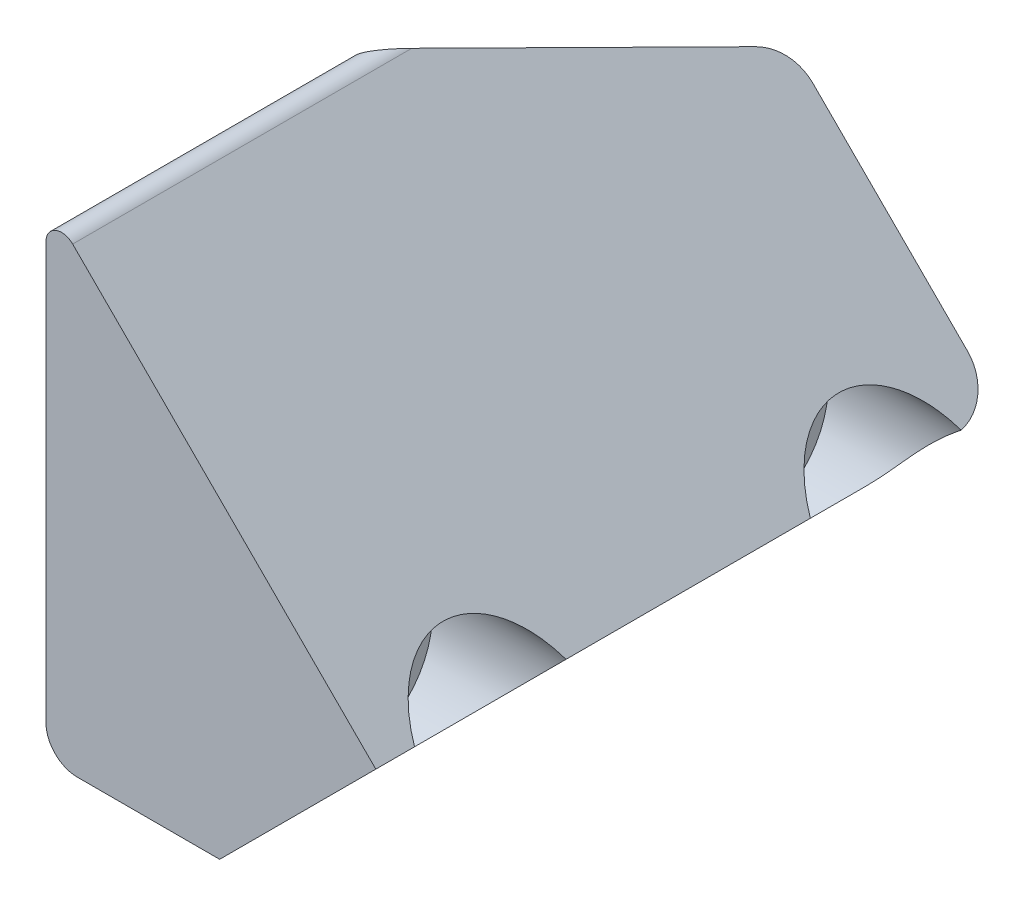
ISO-10303-21;
HEADER;
FILE_DESCRIPTION(('STEP AP214'),'2;1');
FILE_NAME('part.step','',(''),(''),'','','');
FILE_SCHEMA(('AUTOMOTIVE_DESIGN { 1 0 10303 214 1 1 1 1 }'));
ENDSEC;
DATA;
#1=APPLICATION_CONTEXT('core data for automotive mechanical design processes');
#2=APPLICATION_PROTOCOL_DEFINITION('international standard','automotive_design',2000,#1);
#3=PRODUCT_CONTEXT('',#1,'mechanical');
#4=PRODUCT('Part','Part','',(#3));
#5=PRODUCT_RELATED_PRODUCT_CATEGORY('part','',(#4));
#6=PRODUCT_DEFINITION_FORMATION('','',#4);
#7=PRODUCT_DEFINITION_CONTEXT('part definition',#1,'design');
#8=PRODUCT_DEFINITION('design','',#6,#7);
#9=PRODUCT_DEFINITION_SHAPE('','',#8);
#10=(LENGTH_UNIT() NAMED_UNIT(*) SI_UNIT(.MILLI.,.METRE.));
#11=(NAMED_UNIT(*) PLANE_ANGLE_UNIT() SI_UNIT($,.RADIAN.));
#12=(NAMED_UNIT(*) SI_UNIT($,.STERADIAN.) SOLID_ANGLE_UNIT());
#13=UNCERTAINTY_MEASURE_WITH_UNIT(LENGTH_MEASURE(1.E-05),#10,'distance_accuracy_value','');
#14=(GEOMETRIC_REPRESENTATION_CONTEXT(3) GLOBAL_UNCERTAINTY_ASSIGNED_CONTEXT((#13)) GLOBAL_UNIT_ASSIGNED_CONTEXT((#10,
#11,#12)) REPRESENTATION_CONTEXT('',''));
#15=CARTESIAN_POINT('',(0.,0.,0.));
#16=DIRECTION('',(0.,0.,1.));
#17=DIRECTION('',(1.,0.,0.));
#18=AXIS2_PLACEMENT_3D('',#15,#16,#17);
#19=CARTESIAN_POINT('',(15.556349186104,0.,20.));
#20=DIRECTION('',(0.,1.,0.));
#21=DIRECTION('',(-1.,0.,0.));
#22=AXIS2_PLACEMENT_3D('',#19,#20,#21);
#23=PLANE('',#22);
#24=DIRECTION('',(1.,0.,0.));
#25=VECTOR('',#24,1.);
#26=CARTESIAN_POINT('',(15.556349186104,0.,0.));
#27=LINE('',#26,#25);
#28=CARTESIAN_POINT('',(0.999999999999999,0.,0.));
#29=VERTEX_POINT('',#28);
#30=CARTESIAN_POINT('',(3.43736979311548,0.,0.));
#31=VERTEX_POINT('',#30);
#32=EDGE_CURVE('E274',#29,#31,#27,.T.);
#33=ORIENTED_EDGE('',*,*,#32,.T.);
#34=CARTESIAN_POINT('',(3.43736979311548,0.,1.5));
#35=DIRECTION('',(0.,1.,0.));
#36=DIRECTION('',(-1.,0.,0.));
#37=AXIS2_PLACEMENT_3D('',#34,#35,#36);
#38=ELLIPSE('',#37,2.12132034355964,1.5);
#39=CARTESIAN_POINT('',(5.55869013667512,0.,1.5));
#40=VERTEX_POINT('',#39);
#41=EDGE_CURVE('E229',#31,#40,#38,.F.);
#42=ORIENTED_EDGE('',*,*,#41,.T.);
#43=DIRECTION('',(0.,0.,1.));
#44=VECTOR('',#43,1.);
#45=CARTESIAN_POINT('',(5.55869013667512,0.,20.));
#46=LINE('',#45,#44);
#47=CARTESIAN_POINT('',(5.55869013667512,0.,20.));
#48=VERTEX_POINT('',#47);
#49=EDGE_CURVE('E217',#40,#48,#46,.T.);
#50=ORIENTED_EDGE('',*,*,#49,.T.);
#51=DIRECTION('',(1.,0.,0.));
#52=VECTOR('',#51,1.);
#53=CARTESIAN_POINT('',(15.556349186104,0.,20.));
#54=LINE('',#53,#52);
#55=CARTESIAN_POINT('',(0.999999999999999,0.,20.));
#56=VERTEX_POINT('',#55);
#57=EDGE_CURVE('E261',#56,#48,#54,.T.);
#58=ORIENTED_EDGE('',*,*,#57,.F.);
#59=DIRECTION('',(0.,0.,-1.));
#60=VECTOR('',#59,1.);
#61=CARTESIAN_POINT('',(0.999999999999999,0.,20.));
#62=LINE('',#61,#60);
#63=EDGE_CURVE('E249',#56,#29,#62,.T.);
#64=ORIENTED_EDGE('',*,*,#63,.T.);
#65=EDGE_LOOP('',(#33,#42,#50,#58,#64));
#66=FACE_BOUND('',#65,.T.);
#67=ADVANCED_FACE('F35',(#66),#23,.F.);
#68=CARTESIAN_POINT('',(0.,15.556349186104,20.));
#69=DIRECTION('',(-0.707106781186548,-0.707106781186548,0.));
#70=DIRECTION('',(0.707106781186548,-0.707106781186548,0.));
#71=AXIS2_PLACEMENT_3D('',#68,#69,#70);
#72=PLANE('',#71);
#73=CARTESIAN_POINT('',(11.7447559635958,3.81159322250824,3.66495523115073));
#74=DIRECTION('',(-0.707106781186548,-0.707106781186548,0.));
#75=DIRECTION('',(-0.707106781186548,0.707106781186548,0.));
#76=AXIS2_PLACEMENT_3D('',#73,#74,#75);
#77=ELLIPSE('',#76,3.81837661840736,2.7);
#78=CARTESIAN_POINT('',(10.5575196613896,4.99882952471446,6.08992326449132));
#79=VERTEX_POINT('',#78);
#80=CARTESIAN_POINT('',(10.5423791763795,5.01397000972457,1.24745857933023));
#81=VERTEX_POINT('',#80);
#82=EDGE_CURVE('E234',#79,#81,#77,.T.);
#83=ORIENTED_EDGE('',*,*,#82,.T.);
#84=CARTESIAN_POINT('',(9.49685948960976,6.05948969649428,1.5));
#85=DIRECTION('',(-0.707106781186548,-0.707106781186548,0.));
#86=DIRECTION('',(0.707106781186548,-0.707106781186548,0.));
#87=AXIS2_PLACEMENT_3D('',#84,#85,#86);
#88=CIRCLE('',#87,1.5);
#89=CARTESIAN_POINT('',(9.49685948960976,6.05948969649428,0.));
#90=VERTEX_POINT('',#89);
#91=EDGE_CURVE('E231',#81,#90,#88,.F.);
#92=ORIENTED_EDGE('',*,*,#91,.T.);
#93=DIRECTION('',(-0.707106781186548,0.707106781186548,0.));
#94=VECTOR('',#93,1.);
#95=CARTESIAN_POINT('',(0.,15.556349186104,0.));
#96=LINE('',#95,#94);
#97=CARTESIAN_POINT('',(4.54453161344022,11.0118175726638,0.));
#98=VERTEX_POINT('',#97);
#99=EDGE_CURVE('E267',#90,#98,#96,.T.);
#100=ORIENTED_EDGE('',*,*,#99,.T.);
#101=CARTESIAN_POINT('',(4.54453161344022,11.0118175726638,1.5));
#102=DIRECTION('',(-0.707106781186548,-0.707106781186548,0.));
#103=DIRECTION('',(0.707106781186548,-0.707106781186548,0.));
#104=AXIS2_PLACEMENT_3D('',#101,#102,#103);
#105=CIRCLE('',#104,1.5);
#106=CARTESIAN_POINT('',(3.58324704035653,11.9731021457475,0.866072607388959));
#107=VERTEX_POINT('',#106);
#108=EDGE_CURVE('E133',#98,#107,#105,.F.);
#109=ORIENTED_EDGE('',*,*,#108,.T.);
#110=DIRECTION('',(0.298836238730115,-0.298836238730115,-0.906307787036653));
#111=VECTOR('',#110,1.);
#112=CARTESIAN_POINT('',(0.135218727052809,15.4211304590512,11.3232210561494));
#113=LINE('',#112,#111);
#114=CARTESIAN_POINT('',(0.853553390593277,14.7027957955108,9.14466231765233));
#115=VERTEX_POINT('',#114);
#116=EDGE_CURVE('E117',#115,#107,#113,.T.);
#117=ORIENTED_EDGE('',*,*,#116,.F.);
#118=DIRECTION('',(0.,0.,-1.));
#119=VECTOR('',#118,1.);
#120=CARTESIAN_POINT('',(0.853553390593275,14.7027957955108,20.));
#121=LINE('',#120,#119);
#122=CARTESIAN_POINT('',(0.853553390593275,14.7027957955108,20.));
#123=VERTEX_POINT('',#122);
#124=EDGE_CURVE('E130',#115,#123,#121,.F.);
#125=ORIENTED_EDGE('',*,*,#124,.T.);
#126=DIRECTION('',(-0.707106781186548,0.707106781186548,0.));
#127=VECTOR('',#126,1.);
#128=CARTESIAN_POINT('',(0.,15.556349186104,20.));
#129=LINE('',#128,#127);
#130=CARTESIAN_POINT('',(10.5575196613896,4.99882952471446,20.));
#131=VERTEX_POINT('',#130);
#132=EDGE_CURVE('E264',#131,#123,#129,.T.);
#133=ORIENTED_EDGE('',*,*,#132,.F.);
#134=DIRECTION('',(0.,0.,1.));
#135=VECTOR('',#134,1.);
#136=CARTESIAN_POINT('',(10.5575196613896,4.99882952471446,20.));
#137=LINE('',#136,#135);
#138=CARTESIAN_POINT('',(10.5575196613896,4.99882952471446,18.7600128021899));
#139=VERTEX_POINT('',#138);
#140=EDGE_CURVE('E292',#139,#131,#137,.T.);
#141=ORIENTED_EDGE('',*,*,#140,.F.);
#142=CARTESIAN_POINT('',(11.7447559635958,3.81159322250824,16.3350447688493));
#143=DIRECTION('',(-0.707106781186548,-0.707106781186548,0.));
#144=DIRECTION('',(-0.707106781186548,0.707106781186548,0.));
#145=AXIS2_PLACEMENT_3D('',#142,#143,#144);
#146=ELLIPSE('',#145,3.81837661840736,2.7);
#147=CARTESIAN_POINT('',(10.5575196613896,4.99882952471446,13.9100767355087));
#148=VERTEX_POINT('',#147);
#149=EDGE_CURVE('E278',#139,#148,#146,.T.);
#150=ORIENTED_EDGE('',*,*,#149,.T.);
#151=EDGE_CURVE('E238',#79,#148,#137,.T.);
#152=ORIENTED_EDGE('',*,*,#151,.F.);
#153=EDGE_LOOP('',(#83,#92,#100,#109,#117,#125,#133,#141,#150,#152));
#154=FACE_BOUND('',#153,.T.);
#155=ADVANCED_FACE('F128',(#154),#72,.F.);
#156=CARTESIAN_POINT('',(0.,0.,20.));
#157=DIRECTION('',(1.,0.,0.));
#158=DIRECTION('',(0.,0.,-1.));
#159=AXIS2_PLACEMENT_3D('',#156,#157,#158);
#160=PLANE('',#159);
#161=CARTESIAN_POINT('',(0.,3.81159322250824,3.66495523115073));
#162=DIRECTION('',(-1.,0.,0.));
#163=DIRECTION('',(0.,0.,1.));
#164=AXIS2_PLACEMENT_3D('',#161,#162,#163);
#165=CIRCLE('',#164,1.6);
#166=CARTESIAN_POINT('',(0.,3.81159322250824,5.26495523115073));
#167=VERTEX_POINT('',#166);
#168=EDGE_CURVE('E279',#167,#167,#165,.T.);
#169=ORIENTED_EDGE('',*,*,#168,.F.);
#170=EDGE_LOOP('',(#169));
#171=FACE_BOUND('',#170,.T.);
#172=CARTESIAN_POINT('',(0.,3.81159322250824,16.3350447688493));
#173=DIRECTION('',(-1.,0.,0.));
#174=DIRECTION('',(0.,0.,1.));
#175=AXIS2_PLACEMENT_3D('',#172,#173,#174);
#176=CIRCLE('',#175,1.6);
#177=CARTESIAN_POINT('',(0.,3.81159322250824,17.9350447688493));
#178=VERTEX_POINT('',#177);
#179=EDGE_CURVE('E270',#178,#178,#176,.T.);
#180=ORIENTED_EDGE('',*,*,#179,.F.);
#181=EDGE_LOOP('',(#180));
#182=FACE_BOUND('',#181,.T.);
#183=DIRECTION('',(0.,-0.550527347484624,-0.834817129478992));
#184=VECTOR('',#183,1.);
#185=CARTESIAN_POINT('',(0.,14.6408099803797,10.3449917366272));
#186=LINE('',#185,#184);
#187=CARTESIAN_POINT('',(0.,14.3492424049175,9.90286001054923));
#188=VERTEX_POINT('',#187);
#189=CARTESIAN_POINT('',(0.,8.38985510539099,0.866072607388959));
#190=VERTEX_POINT('',#189);
#191=EDGE_CURVE('E118',#188,#190,#186,.T.);
#192=ORIENTED_EDGE('',*,*,#191,.T.);
#193=CARTESIAN_POINT('',(0.,6.46728595922361,1.5));
#194=DIRECTION('',(1.,0.,0.));
#195=DIRECTION('',(0.,-1.,0.));
#196=AXIS2_PLACEMENT_3D('',#193,#194,#195);
#197=ELLIPSE('',#196,2.12132034355964,1.5);
#198=CARTESIAN_POINT('',(0.,6.46728595922361,0.));
#199=VERTEX_POINT('',#198);
#200=EDGE_CURVE('E11',#190,#199,#197,.F.);
#201=ORIENTED_EDGE('',*,*,#200,.T.);
#202=DIRECTION('',(0.,-1.,0.));
#203=VECTOR('',#202,1.);
#204=CARTESIAN_POINT('',(0.,0.,0.));
#205=LINE('',#204,#203);
#206=CARTESIAN_POINT('',(0.,1.,0.));
#207=VERTEX_POINT('',#206);
#208=EDGE_CURVE('E259',#199,#207,#205,.T.);
#209=ORIENTED_EDGE('',*,*,#208,.T.);
#210=DIRECTION('',(0.,0.,-1.));
#211=VECTOR('',#210,1.);
#212=CARTESIAN_POINT('',(0.,1.,20.));
#213=LINE('',#212,#211);
#214=CARTESIAN_POINT('',(0.,1.,20.));
#215=VERTEX_POINT('',#214);
#216=EDGE_CURVE('E142',#207,#215,#213,.F.);
#217=ORIENTED_EDGE('',*,*,#216,.T.);
#218=DIRECTION('',(0.,-1.,0.));
#219=VECTOR('',#218,1.);
#220=CARTESIAN_POINT('',(0.,0.,20.));
#221=LINE('',#220,#219);
#222=CARTESIAN_POINT('',(0.,14.3492424049175,20.));
#223=VERTEX_POINT('',#222);
#224=EDGE_CURVE('E253',#223,#215,#221,.T.);
#225=ORIENTED_EDGE('',*,*,#224,.F.);
#226=DIRECTION('',(0.,0.,-1.));
#227=VECTOR('',#226,1.);
#228=CARTESIAN_POINT('',(0.,14.3492424049175,20.));
#229=LINE('',#228,#227);
#230=EDGE_CURVE('E140',#223,#188,#229,.T.);
#231=ORIENTED_EDGE('',*,*,#230,.T.);
#232=EDGE_LOOP('',(#192,#201,#209,#217,#225,#231));
#233=FACE_BOUND('',#232,.T.);
#234=ADVANCED_FACE('F189',(#171,#182,#233),#160,.F.);
#235=CARTESIAN_POINT('',(0.,0.,20.));
#236=DIRECTION('',(0.,0.,-1.));
#237=DIRECTION('',(-1.,0.,0.));
#238=AXIS2_PLACEMENT_3D('',#235,#236,#237);
#239=PLANE('',#238);
#240=ORIENTED_EDGE('',*,*,#57,.T.);
#241=DIRECTION('',(0.707106781186548,0.707106781186547,0.));
#242=VECTOR('',#241,1.);
#243=CARTESIAN_POINT('',(3.48645184952411,-2.07223828715101,20.));
#244=LINE('',#243,#242);
#245=EDGE_CURVE('E220',#48,#131,#244,.T.);
#246=ORIENTED_EDGE('',*,*,#245,.T.);
#247=ORIENTED_EDGE('',*,*,#132,.T.);
#248=CARTESIAN_POINT('',(0.5,14.3492424049175,20.));
#249=DIRECTION('',(0.,0.,-1.));
#250=DIRECTION('',(-1.,0.,0.));
#251=AXIS2_PLACEMENT_3D('',#248,#249,#250);
#252=CIRCLE('',#251,0.5);
#253=EDGE_CURVE('E137',#123,#223,#252,.F.);
#254=ORIENTED_EDGE('',*,*,#253,.T.);
#255=ORIENTED_EDGE('',*,*,#224,.T.);
#256=CARTESIAN_POINT('',(0.999999999999999,1.,20.));
#257=DIRECTION('',(0.,0.,-1.));
#258=DIRECTION('',(-1.,0.,0.));
#259=AXIS2_PLACEMENT_3D('',#256,#257,#258);
#260=CIRCLE('',#259,1.);
#261=EDGE_CURVE('E138',#215,#56,#260,.F.);
#262=ORIENTED_EDGE('',*,*,#261,.T.);
#263=EDGE_LOOP('',(#240,#246,#247,#254,#255,#262));
#264=FACE_BOUND('',#263,.T.);
#265=ADVANCED_FACE('F186',(#264),#239,.F.);
#266=CARTESIAN_POINT('',(0.,0.,0.));
#267=DIRECTION('',(0.,0.,-1.));
#268=DIRECTION('',(-1.,0.,0.));
#269=AXIS2_PLACEMENT_3D('',#266,#267,#268);
#270=PLANE('',#269);
#271=ORIENTED_EDGE('',*,*,#99,.F.);
#272=DIRECTION('',(0.707106781186548,0.707106781186547,0.));
#273=VECTOR('',#272,1.);
#274=CARTESIAN_POINT('',(4.4980299648953,1.06066017177982,0.));
#275=LINE('',#274,#273);
#276=EDGE_CURVE('E298',#90,#31,#275,.F.);
#277=ORIENTED_EDGE('',*,*,#276,.T.);
#278=ORIENTED_EDGE('',*,*,#32,.F.);
#279=CARTESIAN_POINT('',(0.999999999999999,1.,0.));
#280=DIRECTION('',(0.,0.,-1.));
#281=DIRECTION('',(-1.,0.,0.));
#282=AXIS2_PLACEMENT_3D('',#279,#280,#281);
#283=CIRCLE('',#282,1.);
#284=EDGE_CURVE('E252',#29,#207,#283,.T.);
#285=ORIENTED_EDGE('',*,*,#284,.T.);
#286=ORIENTED_EDGE('',*,*,#208,.F.);
#287=DIRECTION('',(0.707106781186548,0.707106781186547,0.));
#288=VECTOR('',#287,1.);
#289=CARTESIAN_POINT('',(4.54453161344022,11.0118175726638,0.));
#290=LINE('',#289,#288);
#291=EDGE_CURVE('E297',#199,#98,#290,.T.);
#292=ORIENTED_EDGE('',*,*,#291,.T.);
#293=EDGE_LOOP('',(#271,#277,#278,#285,#286,#292));
#294=FACE_BOUND('',#293,.T.);
#295=ADVANCED_FACE('F184',(#294),#270,.T.);
#296=CARTESIAN_POINT('',(15.556349186104,3.81159322250824,16.3350447688493));
#297=DIRECTION('',(-1.,0.,0.));
#298=DIRECTION('',(0.,0.,1.));
#299=AXIS2_PLACEMENT_3D('',#296,#297,#298);
#300=CYLINDRICAL_SURFACE('',#299,1.6);
#301=CARTESIAN_POINT('',(6.,3.81159322250824,16.3350447688493));
#302=DIRECTION('',(-1.,0.,0.));
#303=DIRECTION('',(0.,0.,1.));
#304=AXIS2_PLACEMENT_3D('',#301,#302,#303);
#305=CIRCLE('',#304,1.6);
#306=CARTESIAN_POINT('',(6.,3.81159322250824,17.9350447688493));
#307=VERTEX_POINT('',#306);
#308=EDGE_CURVE('E243',#307,#307,#305,.F.);
#309=ORIENTED_EDGE('',*,*,#308,.T.);
#310=EDGE_LOOP('',(#309));
#311=FACE_BOUND('',#310,.T.);
#312=ORIENTED_EDGE('',*,*,#179,.T.);
#313=EDGE_LOOP('',(#312));
#314=FACE_BOUND('',#313,.T.);
#315=ADVANCED_FACE('F180',(#311,#314),#300,.F.);
#316=CARTESIAN_POINT('',(15.556349186104,3.81159322250824,3.66495523115073));
#317=DIRECTION('',(-1.,0.,0.));
#318=DIRECTION('',(0.,0.,1.));
#319=AXIS2_PLACEMENT_3D('',#316,#317,#318);
#320=CYLINDRICAL_SURFACE('',#319,1.6);
#321=CARTESIAN_POINT('',(6.,3.81159322250824,3.66495523115073));
#322=DIRECTION('',(-1.,0.,0.));
#323=DIRECTION('',(0.,0.,1.));
#324=AXIS2_PLACEMENT_3D('',#321,#322,#323);
#325=CIRCLE('',#324,1.6);
#326=CARTESIAN_POINT('',(6.,3.81159322250824,5.26495523115073));
#327=VERTEX_POINT('',#326);
#328=EDGE_CURVE('E240',#327,#327,#325,.F.);
#329=ORIENTED_EDGE('',*,*,#328,.T.);
#330=EDGE_LOOP('',(#329));
#331=FACE_BOUND('',#330,.T.);
#332=ORIENTED_EDGE('',*,*,#168,.T.);
#333=EDGE_LOOP('',(#332));
#334=FACE_BOUND('',#333,.T.);
#335=ADVANCED_FACE('F176',(#331,#334),#320,.F.);
#336=CARTESIAN_POINT('',(15.556349186104,3.81159322250824,16.3350447688493));
#337=DIRECTION('',(-1.,0.,0.));
#338=DIRECTION('',(0.,0.,1.));
#339=AXIS2_PLACEMENT_3D('',#336,#337,#338);
#340=CYLINDRICAL_SURFACE('',#339,2.7);
#341=CARTESIAN_POINT('',(6.,3.81159322250824,16.3350447688493));
#342=DIRECTION('',(-1.,0.,0.));
#343=DIRECTION('',(0.,0.,1.));
#344=AXIS2_PLACEMENT_3D('',#341,#342,#343);
#345=CIRCLE('',#344,2.7);
#346=CARTESIAN_POINT('',(6.,3.81159322250824,19.0350447688493));
#347=VERTEX_POINT('',#346);
#348=EDGE_CURVE('E239',#347,#347,#345,.T.);
#349=ORIENTED_EDGE('',*,*,#348,.T.);
#350=EDGE_LOOP('',(#349));
#351=FACE_BOUND('',#350,.T.);
#352=ORIENTED_EDGE('',*,*,#149,.F.);
#353=CARTESIAN_POINT('',(9.37028335918336,3.81159322250824,16.3350447688493));
#354=DIRECTION('',(-0.707106781186547,0.707106781186548,0.));
#355=DIRECTION('',(-0.707106781186548,-0.707106781186547,0.));
#356=AXIS2_PLACEMENT_3D('',#353,#354,#355);
#357=ELLIPSE('',#356,3.81837661840736,2.7);
#358=EDGE_CURVE('E224',#139,#148,#357,.F.);
#359=ORIENTED_EDGE('',*,*,#358,.T.);
#360=EDGE_LOOP('',(#352,#359));
#361=FACE_BOUND('',#360,.T.);
#362=ADVANCED_FACE('F172',(#351,#361),#340,.F.);
#363=CARTESIAN_POINT('',(6.,3.81159322250824,16.3350447688493));
#364=DIRECTION('',(-1.,0.,0.));
#365=DIRECTION('',(0.,0.,1.));
#366=AXIS2_PLACEMENT_3D('',#363,#364,#365);
#367=PLANE('',#366);
#368=ORIENTED_EDGE('',*,*,#348,.F.);
#369=EDGE_LOOP('',(#368));
#370=FACE_BOUND('',#369,.T.);
#371=ORIENTED_EDGE('',*,*,#308,.F.);
#372=EDGE_LOOP('',(#371));
#373=FACE_BOUND('',#372,.T.);
#374=ADVANCED_FACE('F167',(#370,#373),#367,.F.);
#375=CARTESIAN_POINT('',(15.556349186104,3.81159322250824,3.66495523115073));
#376=DIRECTION('',(-1.,0.,0.));
#377=DIRECTION('',(0.,0.,1.));
#378=AXIS2_PLACEMENT_3D('',#375,#376,#377);
#379=CYLINDRICAL_SURFACE('',#378,2.7);
#380=CARTESIAN_POINT('',(6.,3.81159322250824,3.66495523115073));
#381=DIRECTION('',(-1.,0.,0.));
#382=DIRECTION('',(0.,0.,1.));
#383=AXIS2_PLACEMENT_3D('',#380,#381,#382);
#384=CIRCLE('',#383,2.7);
#385=CARTESIAN_POINT('',(6.,3.81159322250824,6.36495523115074));
#386=VERTEX_POINT('',#385);
#387=EDGE_CURVE('E223',#386,#386,#384,.T.);
#388=ORIENTED_EDGE('',*,*,#387,.T.);
#389=EDGE_LOOP('',(#388));
#390=FACE_BOUND('',#389,.T.);
#391=CARTESIAN_POINT('',(9.37028335918336,3.81159322250824,3.66495523115073));
#392=DIRECTION('',(-0.707106781186547,0.707106781186548,0.));
#393=DIRECTION('',(-0.707106781186548,-0.707106781186547,0.));
#394=AXIS2_PLACEMENT_3D('',#391,#392,#393);
#395=ELLIPSE('',#394,3.81837661840736,2.7);
#396=CARTESIAN_POINT('',(7.75691147176463,2.19822133508951,1.5));
#397=VERTEX_POINT('',#396);
#398=EDGE_CURVE('E124',#79,#397,#395,.F.);
#399=ORIENTED_EDGE('',*,*,#398,.T.);
#400=CARTESIAN_POINT('',(7.75691147176463,2.19822133508951,1.5));
#401=CARTESIAN_POINT('',(7.79560107452019,2.23690832325925,1.4711596198949));
#402=CARTESIAN_POINT('',(7.83404678249751,2.27653263949438,1.44325368699807));
#403=CARTESIAN_POINT('',(7.91067124777409,2.35740279371448,1.38950452191707));
#404=CARTESIAN_POINT('',(7.94885001250828,2.39864858632432,1.36366123207347));
#405=CARTESIAN_POINT('',(8.02515281335903,2.48249893103933,1.31423649185011));
#406=CARTESIAN_POINT('',(8.06327686186911,2.5251030968532,1.29065440594518));
#407=CARTESIAN_POINT('',(8.1396798471014,2.61140779941352,1.245880970327));
#408=CARTESIAN_POINT('',(8.17795878237837,2.65510832594958,1.22468959835912));
#409=CARTESIAN_POINT('',(8.29270751738102,2.78675025820727,1.1651743714445));
#410=CARTESIAN_POINT('',(8.36970149615719,2.87592058624889,1.13050541630845));
#411=CARTESIAN_POINT('',(8.52610324879151,3.05543927480526,1.07127450897961));
#412=CARTESIAN_POINT('',(8.60551061736778,3.14578743608646,1.04671086975663));
#413=CARTESIAN_POINT('',(8.76858533545721,3.32749454546965,1.00705306016127));
#414=CARTESIAN_POINT('',(8.85230152605375,3.41884536784551,0.992122895409445));
#415=CARTESIAN_POINT('',(9.02268690919458,3.59984682780757,0.971728797693238));
#416=CARTESIAN_POINT('',(9.10935676119412,3.68949707866479,0.966266993008136));
#417=CARTESIAN_POINT('',(9.28534398916105,3.86667850444122,0.964059261766733));
#418=CARTESIAN_POINT('',(9.37466731711435,3.95420396584824,0.967334666013246));
#419=CARTESIAN_POINT('',(9.55499854246448,4.12677333144805,0.982015645431919));
#420=CARTESIAN_POINT('',(9.64600630464595,4.21181743342826,0.993420570752681));
#421=CARTESIAN_POINT('',(9.80499935471357,4.35777243479724,1.02002343391247));
#422=CARTESIAN_POINT('',(9.87281066719614,4.41920262407516,1.03346113951365));
#423=CARTESIAN_POINT('',(10.0084319256153,4.54095369854412,1.06457474981712));
#424=CARTESIAN_POINT('',(10.0762418684967,4.60127482759287,1.08224971054604));
#425=CARTESIAN_POINT('',(10.2110837379883,4.72070770318462,1.12183478572001));
#426=CARTESIAN_POINT('',(10.27811784264,4.77982389488785,1.1437239540809));
#427=CARTESIAN_POINT('',(10.4111674901697,4.89736794982616,1.19208380691431));
#428=CARTESIAN_POINT('',(10.4771826809093,4.95579557351146,1.21855603832328));
#429=CARTESIAN_POINT('',(10.54237917638,5.01397000972409,1.24745857932994));
#430=B_SPLINE_CURVE_WITH_KNOTS('',3,(#400,#401,#402,#403,#404,#405,#406,#407,#408,#409,#410,
#411,#412,#413,#414,#415,#416,#417,#418,#419,#420,#421,#422,#423,#424,#425,#426,#427,#428,#429),
.UNSPECIFIED.,.F.,.F.,(4,2,2,2,2,2,2,2,2,2,2,2,2,2,4),(0.,0.185530626496004,0.371056064824245,
0.556529206311508,0.742000621128398,1.10993506552845,1.47780806022654,1.85178930900989,
2.2258546096655,2.60083397926752,2.9757833774183,3.25312736160112,3.53040961656731,
3.8063476925825,4.08237908912403),.UNSPECIFIED.);
#431=EDGE_CURVE('E151',#397,#81,#430,.T.);
#432=ORIENTED_EDGE('',*,*,#431,.T.);
#433=ORIENTED_EDGE('',*,*,#82,.F.);
#434=EDGE_LOOP('',(#399,#432,#433));
#435=FACE_BOUND('',#434,.T.);
#436=ADVANCED_FACE('F161',(#390,#435),#379,.F.);
#437=CARTESIAN_POINT('',(6.,3.81159322250824,3.66495523115073));
#438=DIRECTION('',(-1.,0.,0.));
#439=DIRECTION('',(0.,0.,1.));
#440=AXIS2_PLACEMENT_3D('',#437,#438,#439);
#441=PLANE('',#440);
#442=ORIENTED_EDGE('',*,*,#387,.F.);
#443=EDGE_LOOP('',(#442));
#444=FACE_BOUND('',#443,.T.);
#445=ORIENTED_EDGE('',*,*,#328,.F.);
#446=EDGE_LOOP('',(#445));
#447=FACE_BOUND('',#446,.T.);
#448=ADVANCED_FACE('F166',(#444,#447),#441,.F.);
#449=CARTESIAN_POINT('',(0.999999999999999,1.,20.));
#450=DIRECTION('',(0.,0.,-1.));
#451=DIRECTION('',(-1.,0.,0.));
#452=AXIS2_PLACEMENT_3D('',#449,#450,#451);
#453=CYLINDRICAL_SURFACE('',#452,1.);
#454=ORIENTED_EDGE('',*,*,#261,.F.);
#455=ORIENTED_EDGE('',*,*,#216,.F.);
#456=ORIENTED_EDGE('',*,*,#284,.F.);
#457=ORIENTED_EDGE('',*,*,#63,.F.);
#458=EDGE_LOOP('',(#454,#455,#456,#457));
#459=FACE_BOUND('',#458,.T.);
#460=ADVANCED_FACE('F202',(#459),#453,.T.);
#461=CARTESIAN_POINT('',(0.5,14.3492424049175,20.));
#462=DIRECTION('',(0.,0.,-1.));
#463=DIRECTION('',(-1.,0.,0.));
#464=AXIS2_PLACEMENT_3D('',#461,#462,#463);
#465=CYLINDRICAL_SURFACE('',#464,0.5);
#466=CARTESIAN_POINT('',(0.5,14.3492424049175,9.14466231765232));
#467=DIRECTION('',(0.640856382055791,-0.640856382055791,0.422618261740693));
#468=DIRECTION('',(0.298836238730115,-0.298836238730115,-0.906307787036653));
#469=AXIS2_PLACEMENT_3D('',#466,#467,#468);
#470=ELLIPSE('',#469,1.18310079157627,0.5);
#471=EDGE_CURVE('E114',#188,#115,#470,.F.);
#472=ORIENTED_EDGE('',*,*,#471,.F.);
#473=ORIENTED_EDGE('',*,*,#230,.F.);
#474=ORIENTED_EDGE('',*,*,#253,.F.);
#475=ORIENTED_EDGE('',*,*,#124,.F.);
#476=EDGE_LOOP('',(#472,#473,#474,#475));
#477=FACE_BOUND('',#476,.T.);
#478=ADVANCED_FACE('F136',(#477),#465,.T.);
#479=CARTESIAN_POINT('',(3.48645184952411,-2.07223828715101,20.));
#480=DIRECTION('',(-0.707106781186547,0.707106781186548,0.));
#481=DIRECTION('',(-0.707106781186548,-0.707106781186547,0.));
#482=AXIS2_PLACEMENT_3D('',#479,#480,#481);
#483=PLANE('',#482);
#484=ORIENTED_EDGE('',*,*,#49,.F.);
#485=DIRECTION('',(0.707106781186548,0.707106781186547,0.));
#486=VECTOR('',#485,1.);
#487=CARTESIAN_POINT('',(10.5575196613896,4.99882952471447,1.5));
#488=LINE('',#487,#486);
#489=EDGE_CURVE('E123',#40,#397,#488,.T.);
#490=ORIENTED_EDGE('',*,*,#489,.T.);
#491=ORIENTED_EDGE('',*,*,#398,.F.);
#492=ORIENTED_EDGE('',*,*,#151,.T.);
#493=ORIENTED_EDGE('',*,*,#358,.F.);
#494=ORIENTED_EDGE('',*,*,#140,.T.);
#495=ORIENTED_EDGE('',*,*,#245,.F.);
#496=EDGE_LOOP('',(#484,#490,#491,#492,#493,#494,#495));
#497=FACE_BOUND('',#496,.T.);
#498=ADVANCED_FACE('F206',(#497),#483,.F.);
#499=CARTESIAN_POINT('',(-6.93584908481267,8.35006264718577,11.3232210561494));
#500=DIRECTION('',(0.640856382055791,-0.640856382055791,0.422618261740693));
#501=DIRECTION('',(0.707106781186547,0.707106781186547,0.));
#502=AXIS2_PLACEMENT_3D('',#499,#500,#501);
#503=PLANE('',#502);
#504=ORIENTED_EDGE('',*,*,#116,.T.);
#505=DIRECTION('',(0.707106781186548,0.707106781186547,0.));
#506=VECTOR('',#505,1.);
#507=CARTESIAN_POINT('',(-0.285569520819791,8.10428558457119,0.86607260738896));
#508=LINE('',#507,#506);
#509=EDGE_CURVE('E43',#107,#190,#508,.F.);
#510=ORIENTED_EDGE('',*,*,#509,.T.);
#511=ORIENTED_EDGE('',*,*,#191,.F.);
#512=ORIENTED_EDGE('',*,*,#471,.T.);
#513=EDGE_LOOP('',(#504,#510,#511,#512));
#514=FACE_BOUND('',#513,.T.);
#515=ADVANCED_FACE('F116',(#514),#503,.F.);
#516=CARTESIAN_POINT('',(2.42579167774429,-1.01157811537119,1.5));
#517=DIRECTION('',(-0.707106781186548,-0.707106781186547,0.));
#518=DIRECTION('',(0.707106781186547,-0.707106781186548,0.));
#519=AXIS2_PLACEMENT_3D('',#516,#517,#518);
#520=CYLINDRICAL_SURFACE('',#519,1.5);
#521=ORIENTED_EDGE('',*,*,#41,.F.);
#522=ORIENTED_EDGE('',*,*,#276,.F.);
#523=ORIENTED_EDGE('',*,*,#91,.F.);
#524=ORIENTED_EDGE('',*,*,#431,.F.);
#525=ORIENTED_EDGE('',*,*,#489,.F.);
#526=EDGE_LOOP('',(#521,#522,#523,#524,#525));
#527=FACE_BOUND('',#526,.T.);
#528=ADVANCED_FACE('F158',(#527),#520,.T.);
#529=CARTESIAN_POINT('',(-3.23364297961181,3.23364297961181,1.5));
#530=DIRECTION('',(-0.707106781186547,-0.707106781186547,0.));
#531=DIRECTION('',(0.707106781186547,-0.707106781186548,0.));
#532=AXIS2_PLACEMENT_3D('',#529,#530,#531);
#533=CYLINDRICAL_SURFACE('',#532,1.5);
#534=ORIENTED_EDGE('',*,*,#200,.F.);
#535=ORIENTED_EDGE('',*,*,#509,.F.);
#536=ORIENTED_EDGE('',*,*,#108,.F.);
#537=ORIENTED_EDGE('',*,*,#291,.F.);
#538=EDGE_LOOP('',(#534,#535,#536,#537));
#539=FACE_BOUND('',#538,.T.);
#540=ADVANCED_FACE('F37',(#539),#533,.T.);
#541=CLOSED_SHELL('',(#67,#155,#234,#265,#295,#315,#335,#362,#374,#436,#448,#460,#478,#498,#515,
#528,#540));
#542=MANIFOLD_SOLID_BREP('B2',#541);
#543=ADVANCED_BREP_SHAPE_REPRESENTATION('',(#18,#542),#14);
#544=SHAPE_DEFINITION_REPRESENTATION(#9,#543);
ENDSEC;
END-ISO-10303-21;
